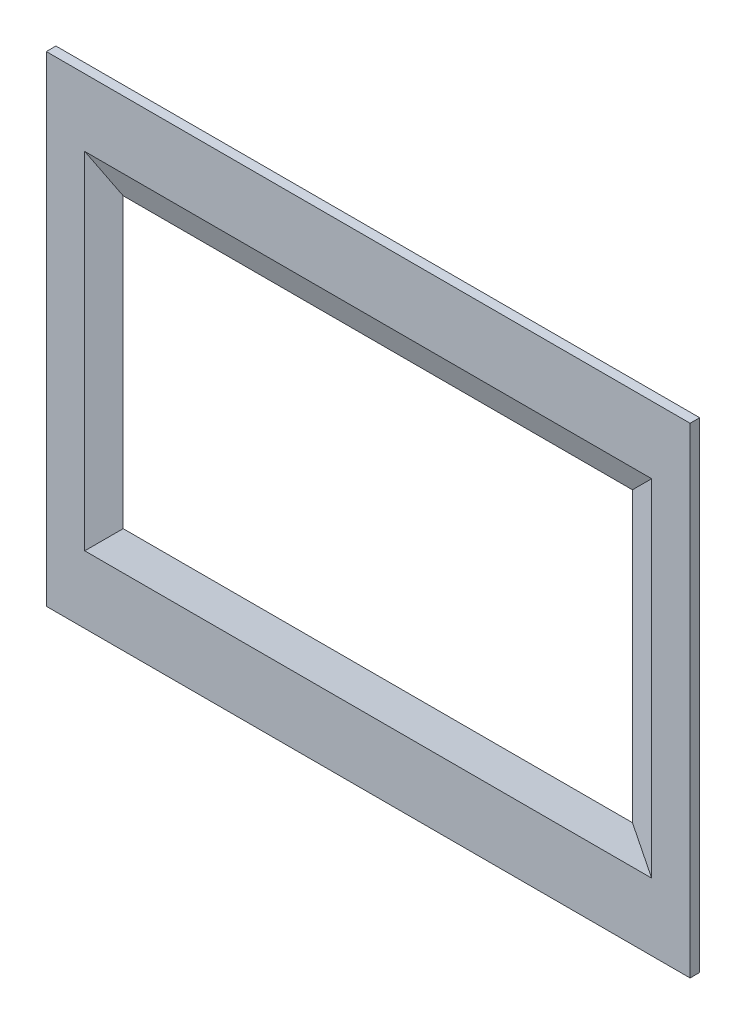
ISO-10303-21;
HEADER;
FILE_DESCRIPTION(('STEP AP214'),'2;1');
FILE_NAME('part.step','',(''),(''),'','','');
FILE_SCHEMA(('AUTOMOTIVE_DESIGN { 1 0 10303 214 1 1 1 1 }'));
ENDSEC;
DATA;
#1=APPLICATION_CONTEXT('core data for automotive mechanical design processes');
#2=APPLICATION_PROTOCOL_DEFINITION('international standard','automotive_design',2000,#1);
#3=PRODUCT_CONTEXT('',#1,'mechanical');
#4=PRODUCT('Part','Part','',(#3));
#5=PRODUCT_RELATED_PRODUCT_CATEGORY('part','',(#4));
#6=PRODUCT_DEFINITION_FORMATION('','',#4);
#7=PRODUCT_DEFINITION_CONTEXT('part definition',#1,'design');
#8=PRODUCT_DEFINITION('design','',#6,#7);
#9=PRODUCT_DEFINITION_SHAPE('','',#8);
#10=(LENGTH_UNIT() NAMED_UNIT(*) SI_UNIT(.MILLI.,.METRE.));
#11=(NAMED_UNIT(*) PLANE_ANGLE_UNIT() SI_UNIT($,.RADIAN.));
#12=(NAMED_UNIT(*) SI_UNIT($,.STERADIAN.) SOLID_ANGLE_UNIT());
#13=UNCERTAINTY_MEASURE_WITH_UNIT(LENGTH_MEASURE(1.E-05),#10,'distance_accuracy_value','');
#14=(GEOMETRIC_REPRESENTATION_CONTEXT(3) GLOBAL_UNCERTAINTY_ASSIGNED_CONTEXT((#13)) GLOBAL_UNIT_ASSIGNED_CONTEXT((#10,
#11,#12)) REPRESENTATION_CONTEXT('',''));
#15=CARTESIAN_POINT('',(0.,0.,0.));
#16=DIRECTION('',(0.,0.,1.));
#17=DIRECTION('',(1.,0.,0.));
#18=AXIS2_PLACEMENT_3D('',#15,#16,#17);
#19=CARTESIAN_POINT('',(0.,500.,10.));
#20=DIRECTION('',(0.,0.,-1.));
#21=DIRECTION('',(-1.,0.,0.));
#22=AXIS2_PLACEMENT_3D('',#19,#20,#21);
#23=PLANE('',#22);
#24=DIRECTION('',(0.,-1.,0.));
#25=VECTOR('',#24,1.);
#26=CARTESIAN_POINT('',(0.,0.,10.));
#27=LINE('',#26,#25);
#28=CARTESIAN_POINT('',(0.,500.,10.));
#29=VERTEX_POINT('',#28);
#30=CARTESIAN_POINT('',(0.,0.,10.));
#31=VERTEX_POINT('',#30);
#32=EDGE_CURVE('E124',#29,#31,#27,.T.);
#33=ORIENTED_EDGE('',*,*,#32,.T.);
#34=DIRECTION('',(1.,0.,0.));
#35=VECTOR('',#34,1.);
#36=CARTESIAN_POINT('',(0.,0.,10.));
#37=LINE('',#36,#35);
#38=CARTESIAN_POINT('',(670.,0.,10.));
#39=VERTEX_POINT('',#38);
#40=EDGE_CURVE('E127',#31,#39,#37,.T.);
#41=ORIENTED_EDGE('',*,*,#40,.T.);
#42=DIRECTION('',(0.,1.,0.));
#43=VECTOR('',#42,1.);
#44=CARTESIAN_POINT('',(670.,0.,10.));
#45=LINE('',#44,#43);
#46=CARTESIAN_POINT('',(670.,500.,10.));
#47=VERTEX_POINT('',#46);
#48=EDGE_CURVE('E130',#39,#47,#45,.T.);
#49=ORIENTED_EDGE('',*,*,#48,.T.);
#50=DIRECTION('',(-1.,0.,0.));
#51=VECTOR('',#50,1.);
#52=CARTESIAN_POINT('',(0.,500.,10.));
#53=LINE('',#52,#51);
#54=EDGE_CURVE('E132',#47,#29,#53,.T.);
#55=ORIENTED_EDGE('',*,*,#54,.T.);
#56=EDGE_LOOP('',(#33,#41,#49,#55));
#57=FACE_BOUND('',#56,.T.);
#58=DIRECTION('',(1.,0.,0.));
#59=VECTOR('',#58,1.);
#60=CARTESIAN_POINT('',(600.,430.000000000001,10.));
#61=LINE('',#60,#59);
#62=CARTESIAN_POINT('',(39.9999999999997,430.000000000001,10.));
#63=VERTEX_POINT('',#62);
#64=CARTESIAN_POINT('',(630.,430.000000000001,10.));
#65=VERTEX_POINT('',#64);
#66=EDGE_CURVE('E48',#63,#65,#61,.T.);
#67=ORIENTED_EDGE('',*,*,#66,.T.);
#68=DIRECTION('',(0.,-1.,0.));
#69=VECTOR('',#68,1.);
#70=CARTESIAN_POINT('',(630.,69.9999999999997,10.));
#71=LINE('',#70,#69);
#72=CARTESIAN_POINT('',(630.,69.9999999999997,10.));
#73=VERTEX_POINT('',#72);
#74=EDGE_CURVE('E104',#65,#73,#71,.T.);
#75=ORIENTED_EDGE('',*,*,#74,.T.);
#76=DIRECTION('',(-1.,0.,0.));
#77=VECTOR('',#76,1.);
#78=CARTESIAN_POINT('',(39.9999999999997,69.9999999999997,10.));
#79=LINE('',#78,#77);
#80=CARTESIAN_POINT('',(39.9999999999997,69.9999999999997,10.));
#81=VERTEX_POINT('',#80);
#82=EDGE_CURVE('E55',#73,#81,#79,.T.);
#83=ORIENTED_EDGE('',*,*,#82,.T.);
#84=DIRECTION('',(0.,1.,0.));
#85=VECTOR('',#84,1.);
#86=CARTESIAN_POINT('',(39.9999999999997,430.000000000001,10.));
#87=LINE('',#86,#85);
#88=EDGE_CURVE('E102',#81,#63,#87,.T.);
#89=ORIENTED_EDGE('',*,*,#88,.T.);
#90=EDGE_LOOP('',(#67,#75,#83,#89));
#91=FACE_BOUND('',#90,.T.);
#92=ADVANCED_FACE('F33',(#57,#91),#23,.F.);
#93=CARTESIAN_POINT('',(0.,500.,0.));
#94=DIRECTION('',(0.,0.,-1.));
#95=DIRECTION('',(-1.,0.,0.));
#96=AXIS2_PLACEMENT_3D('',#93,#94,#95);
#97=PLANE('',#96);
#98=DIRECTION('',(0.,-1.,0.));
#99=VECTOR('',#98,1.);
#100=CARTESIAN_POINT('',(0.,0.,0.));
#101=LINE('',#100,#99);
#102=CARTESIAN_POINT('',(0.,500.,0.));
#103=VERTEX_POINT('',#102);
#104=CARTESIAN_POINT('',(0.,0.,0.));
#105=VERTEX_POINT('',#104);
#106=EDGE_CURVE('E123',#103,#105,#101,.T.);
#107=ORIENTED_EDGE('',*,*,#106,.F.);
#108=DIRECTION('',(-1.,0.,0.));
#109=VECTOR('',#108,1.);
#110=CARTESIAN_POINT('',(0.,500.,0.));
#111=LINE('',#110,#109);
#112=CARTESIAN_POINT('',(670.,500.,0.));
#113=VERTEX_POINT('',#112);
#114=EDGE_CURVE('E128',#113,#103,#111,.T.);
#115=ORIENTED_EDGE('',*,*,#114,.F.);
#116=DIRECTION('',(0.,1.,0.));
#117=VECTOR('',#116,1.);
#118=CARTESIAN_POINT('',(670.,0.,0.));
#119=LINE('',#118,#117);
#120=CARTESIAN_POINT('',(670.,0.,0.));
#121=VERTEX_POINT('',#120);
#122=EDGE_CURVE('E139',#121,#113,#119,.T.);
#123=ORIENTED_EDGE('',*,*,#122,.F.);
#124=DIRECTION('',(1.,0.,0.));
#125=VECTOR('',#124,1.);
#126=CARTESIAN_POINT('',(0.,0.,0.));
#127=LINE('',#126,#125);
#128=EDGE_CURVE('E137',#105,#121,#127,.T.);
#129=ORIENTED_EDGE('',*,*,#128,.F.);
#130=EDGE_LOOP('',(#107,#115,#123,#129));
#131=FACE_BOUND('',#130,.T.);
#132=DIRECTION('',(-1.,0.,0.));
#133=VECTOR('',#132,1.);
#134=CARTESIAN_POINT('',(70.0000000000001,400.,0.));
#135=LINE('',#134,#133);
#136=CARTESIAN_POINT('',(600.,400.,0.));
#137=VERTEX_POINT('',#136);
#138=CARTESIAN_POINT('',(70.0000000000001,400.,0.));
#139=VERTEX_POINT('',#138);
#140=EDGE_CURVE('E114',#137,#139,#135,.T.);
#141=ORIENTED_EDGE('',*,*,#140,.T.);
#142=DIRECTION('',(0.,-1.,0.));
#143=VECTOR('',#142,1.);
#144=CARTESIAN_POINT('',(70.0000000000001,400.,0.));
#145=LINE('',#144,#143);
#146=CARTESIAN_POINT('',(70.0000000000001,100.,0.));
#147=VERTEX_POINT('',#146);
#148=EDGE_CURVE('E101',#139,#147,#145,.T.);
#149=ORIENTED_EDGE('',*,*,#148,.T.);
#150=DIRECTION('',(1.,0.,0.));
#151=VECTOR('',#150,1.);
#152=CARTESIAN_POINT('',(70.0000000000001,100.,0.));
#153=LINE('',#152,#151);
#154=CARTESIAN_POINT('',(600.,100.,0.));
#155=VERTEX_POINT('',#154);
#156=EDGE_CURVE('E111',#147,#155,#153,.T.);
#157=ORIENTED_EDGE('',*,*,#156,.T.);
#158=DIRECTION('',(0.,1.,0.));
#159=VECTOR('',#158,1.);
#160=CARTESIAN_POINT('',(600.,400.,0.));
#161=LINE('',#160,#159);
#162=EDGE_CURVE('E118',#155,#137,#161,.T.);
#163=ORIENTED_EDGE('',*,*,#162,.T.);
#164=EDGE_LOOP('',(#141,#149,#157,#163));
#165=FACE_BOUND('',#164,.T.);
#166=ADVANCED_FACE('F109',(#131,#165),#97,.T.);
#167=CARTESIAN_POINT('',(0.,0.,10.));
#168=DIRECTION('',(1.,0.,0.));
#169=DIRECTION('',(0.,0.,-1.));
#170=AXIS2_PLACEMENT_3D('',#167,#168,#169);
#171=PLANE('',#170);
#172=ORIENTED_EDGE('',*,*,#106,.T.);
#173=DIRECTION('',(0.,0.,-1.));
#174=VECTOR('',#173,1.);
#175=CARTESIAN_POINT('',(0.,0.,10.));
#176=LINE('',#175,#174);
#177=EDGE_CURVE('E150',#31,#105,#176,.T.);
#178=ORIENTED_EDGE('',*,*,#177,.F.);
#179=ORIENTED_EDGE('',*,*,#32,.F.);
#180=DIRECTION('',(0.,0.,-1.));
#181=VECTOR('',#180,1.);
#182=CARTESIAN_POINT('',(0.,500.,10.));
#183=LINE('',#182,#181);
#184=EDGE_CURVE('E134',#29,#103,#183,.T.);
#185=ORIENTED_EDGE('',*,*,#184,.T.);
#186=EDGE_LOOP('',(#172,#178,#179,#185));
#187=FACE_BOUND('',#186,.T.);
#188=ADVANCED_FACE('F168',(#187),#171,.F.);
#189=CARTESIAN_POINT('',(0.,0.,10.));
#190=DIRECTION('',(0.,1.,0.));
#191=DIRECTION('',(0.,0.,1.));
#192=AXIS2_PLACEMENT_3D('',#189,#190,#191);
#193=PLANE('',#192);
#194=ORIENTED_EDGE('',*,*,#128,.T.);
#195=DIRECTION('',(0.,0.,-1.));
#196=VECTOR('',#195,1.);
#197=CARTESIAN_POINT('',(670.,0.,10.));
#198=LINE('',#197,#196);
#199=EDGE_CURVE('E147',#39,#121,#198,.T.);
#200=ORIENTED_EDGE('',*,*,#199,.F.);
#201=ORIENTED_EDGE('',*,*,#40,.F.);
#202=ORIENTED_EDGE('',*,*,#177,.T.);
#203=EDGE_LOOP('',(#194,#200,#201,#202));
#204=FACE_BOUND('',#203,.T.);
#205=ADVANCED_FACE('F179',(#204),#193,.F.);
#206=CARTESIAN_POINT('',(670.,0.,10.));
#207=DIRECTION('',(-1.,0.,0.));
#208=DIRECTION('',(0.,0.,1.));
#209=AXIS2_PLACEMENT_3D('',#206,#207,#208);
#210=PLANE('',#209);
#211=ORIENTED_EDGE('',*,*,#122,.T.);
#212=DIRECTION('',(0.,0.,-1.));
#213=VECTOR('',#212,1.);
#214=CARTESIAN_POINT('',(670.,500.,10.));
#215=LINE('',#214,#213);
#216=EDGE_CURVE('E144',#47,#113,#215,.T.);
#217=ORIENTED_EDGE('',*,*,#216,.F.);
#218=ORIENTED_EDGE('',*,*,#48,.F.);
#219=ORIENTED_EDGE('',*,*,#199,.T.);
#220=EDGE_LOOP('',(#211,#217,#218,#219));
#221=FACE_BOUND('',#220,.T.);
#222=ADVANCED_FACE('F175',(#221),#210,.F.);
#223=CARTESIAN_POINT('',(0.,500.,10.));
#224=DIRECTION('',(0.,-1.,0.));
#225=DIRECTION('',(0.,0.,-1.));
#226=AXIS2_PLACEMENT_3D('',#223,#224,#225);
#227=PLANE('',#226);
#228=ORIENTED_EDGE('',*,*,#114,.T.);
#229=ORIENTED_EDGE('',*,*,#184,.F.);
#230=ORIENTED_EDGE('',*,*,#54,.F.);
#231=ORIENTED_EDGE('',*,*,#216,.T.);
#232=EDGE_LOOP('',(#228,#229,#230,#231));
#233=FACE_BOUND('',#232,.T.);
#234=ADVANCED_FACE('F172',(#233),#227,.F.);
#235=CARTESIAN_POINT('',(70.0000000000001,400.,0.));
#236=DIRECTION('',(0.,-0.316227766016835,0.948683298050515));
#237=DIRECTION('',(0.,-0.948683298050515,-0.316227766016835));
#238=AXIS2_PLACEMENT_3D('',#235,#236,#237);
#239=PLANE('',#238);
#240=ORIENTED_EDGE('',*,*,#140,.F.);
#241=DIRECTION('',(0.688247201611687,0.688247201611684,0.229415733870559));
#242=VECTOR('',#241,1.);
#243=CARTESIAN_POINT('',(600.,400.,0.));
#244=LINE('',#243,#242);
#245=EDGE_CURVE('E41',#137,#65,#244,.T.);
#246=ORIENTED_EDGE('',*,*,#245,.T.);
#247=ORIENTED_EDGE('',*,*,#66,.F.);
#248=DIRECTION('',(0.688247201611684,-0.688247201611687,-0.22941573387056));
#249=VECTOR('',#248,1.);
#250=CARTESIAN_POINT('',(70.0000000000001,400.,0.));
#251=LINE('',#250,#249);
#252=EDGE_CURVE('E155',#63,#139,#251,.T.);
#253=ORIENTED_EDGE('',*,*,#252,.T.);
#254=EDGE_LOOP('',(#240,#246,#247,#253));
#255=FACE_BOUND('',#254,.T.);
#256=ADVANCED_FACE('F160',(#255),#239,.T.);
#257=CARTESIAN_POINT('',(70.0000000000001,400.,0.));
#258=DIRECTION('',(0.316227766016836,0.,0.948683298050514));
#259=DIRECTION('',(0.948683298050514,0.,-0.316227766016836));
#260=AXIS2_PLACEMENT_3D('',#257,#258,#259);
#261=PLANE('',#260);
#262=ORIENTED_EDGE('',*,*,#252,.F.);
#263=ORIENTED_EDGE('',*,*,#88,.F.);
#264=DIRECTION('',(0.688247201611686,0.688247201611685,-0.229415733870561));
#265=VECTOR('',#264,1.);
#266=CARTESIAN_POINT('',(70.0000000000001,100.,0.));
#267=LINE('',#266,#265);
#268=EDGE_CURVE('E97',#81,#147,#267,.T.);
#269=ORIENTED_EDGE('',*,*,#268,.T.);
#270=ORIENTED_EDGE('',*,*,#148,.F.);
#271=EDGE_LOOP('',(#262,#263,#269,#270));
#272=FACE_BOUND('',#271,.T.);
#273=ADVANCED_FACE('F100',(#272),#261,.T.);
#274=CARTESIAN_POINT('',(70.0000000000001,100.,0.));
#275=DIRECTION('',(0.,0.316227766016837,0.948683298050514));
#276=DIRECTION('',(0.,-0.948683298050514,0.316227766016837));
#277=AXIS2_PLACEMENT_3D('',#274,#275,#276);
#278=PLANE('',#277);
#279=ORIENTED_EDGE('',*,*,#268,.F.);
#280=ORIENTED_EDGE('',*,*,#82,.F.);
#281=DIRECTION('',(-0.688247201611689,0.688247201611683,-0.22941573387056));
#282=VECTOR('',#281,1.);
#283=CARTESIAN_POINT('',(457.894736842105,242.105263157893,-47.368421052631));
#284=LINE('',#283,#282);
#285=EDGE_CURVE('E11',#73,#155,#284,.T.);
#286=ORIENTED_EDGE('',*,*,#285,.T.);
#287=ORIENTED_EDGE('',*,*,#156,.F.);
#288=EDGE_LOOP('',(#279,#280,#286,#287));
#289=FACE_BOUND('',#288,.T.);
#290=ADVANCED_FACE('F116',(#289),#278,.T.);
#291=CARTESIAN_POINT('',(600.,400.,0.));
#292=DIRECTION('',(-0.316227766016834,0.,0.948683298050515));
#293=DIRECTION('',(0.948683298050515,0.,0.316227766016834));
#294=AXIS2_PLACEMENT_3D('',#291,#292,#293);
#295=PLANE('',#294);
#296=ORIENTED_EDGE('',*,*,#285,.F.);
#297=ORIENTED_EDGE('',*,*,#74,.F.);
#298=ORIENTED_EDGE('',*,*,#245,.F.);
#299=ORIENTED_EDGE('',*,*,#162,.F.);
#300=EDGE_LOOP('',(#296,#297,#298,#299));
#301=FACE_BOUND('',#300,.T.);
#302=ADVANCED_FACE('F35',(#301),#295,.T.);
#303=CLOSED_SHELL('',(#92,#166,#188,#205,#222,#234,#256,#273,#290,#302));
#304=MANIFOLD_SOLID_BREP('B2',#303);
#305=ADVANCED_BREP_SHAPE_REPRESENTATION('',(#18,#304),#14);
#306=SHAPE_DEFINITION_REPRESENTATION(#9,#305);
ENDSEC;
END-ISO-10303-21;
